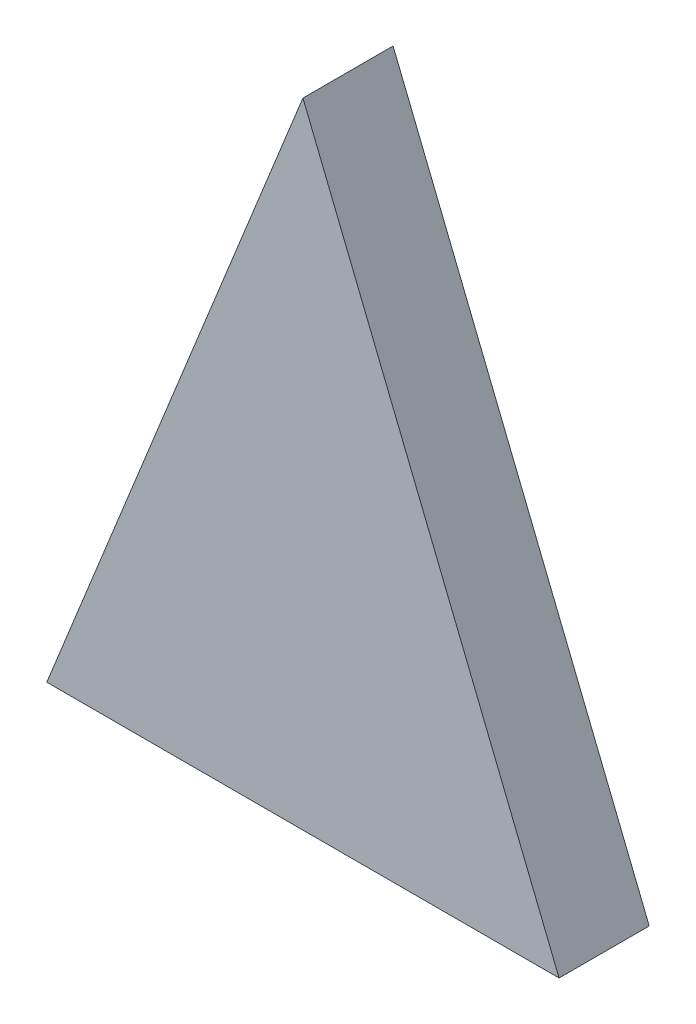
ISO-10303-21;
HEADER;
FILE_DESCRIPTION(('STEP AP214'),'2;1');
FILE_NAME('part.step','',(''),(''),'','','');
FILE_SCHEMA(('AUTOMOTIVE_DESIGN { 1 0 10303 214 1 1 1 1 }'));
ENDSEC;
DATA;
#1=APPLICATION_CONTEXT('core data for automotive mechanical design processes');
#2=APPLICATION_PROTOCOL_DEFINITION('international standard','automotive_design',2000,#1);
#3=PRODUCT_CONTEXT('',#1,'mechanical');
#4=PRODUCT('Part','Part','',(#3));
#5=PRODUCT_RELATED_PRODUCT_CATEGORY('part','',(#4));
#6=PRODUCT_DEFINITION_FORMATION('','',#4);
#7=PRODUCT_DEFINITION_CONTEXT('part definition',#1,'design');
#8=PRODUCT_DEFINITION('design','',#6,#7);
#9=PRODUCT_DEFINITION_SHAPE('','',#8);
#10=(LENGTH_UNIT() NAMED_UNIT(*) SI_UNIT(.MILLI.,.METRE.));
#11=(NAMED_UNIT(*) PLANE_ANGLE_UNIT() SI_UNIT($,.RADIAN.));
#12=(NAMED_UNIT(*) SI_UNIT($,.STERADIAN.) SOLID_ANGLE_UNIT());
#13=UNCERTAINTY_MEASURE_WITH_UNIT(LENGTH_MEASURE(1.E-05),#10,'distance_accuracy_value','');
#14=(GEOMETRIC_REPRESENTATION_CONTEXT(3) GLOBAL_UNCERTAINTY_ASSIGNED_CONTEXT((#13)) GLOBAL_UNIT_ASSIGNED_CONTEXT((#10,
#11,#12)) REPRESENTATION_CONTEXT('',''));
#15=CARTESIAN_POINT('',(0.,0.,0.));
#16=DIRECTION('',(0.,0.,1.));
#17=DIRECTION('',(1.,0.,0.));
#18=AXIS2_PLACEMENT_3D('',#15,#16,#17);
#19=CARTESIAN_POINT('',(0.029884469337526,-0.513978221792353,0.));
#20=DIRECTION('',(0.927183854567569,0.374606593413977,0.));
#21=DIRECTION('',(-0.374606593413977,0.927183854567569,0.));
#22=AXIS2_PLACEMENT_3D('',#19,#20,#21);
#23=PLANE('',#22);
#24=DIRECTION('',(-0.374606593413977,0.927183854567569,0.));
#25=VECTOR('',#24,1.);
#26=CARTESIAN_POINT('',(0.029884469337526,-0.513978221792353,0.));
#27=LINE('',#26,#25);
#28=CARTESIAN_POINT('',(0.029884469337526,-0.513978221792353,0.));
#29=VERTEX_POINT('',#28);
#30=CARTESIAN_POINT('',(0.0213589431958611,-0.492876804120534,0.));
#31=VERTEX_POINT('',#30);
#32=EDGE_CURVE('E11',#29,#31,#27,.T.);
#33=ORIENTED_EDGE('',*,*,#32,.T.);
#34=DIRECTION('',(0.,0.,1.));
#35=VECTOR('',#34,1.);
#36=CARTESIAN_POINT('',(0.0213589431958611,-0.492876804120534,0.));
#37=LINE('',#36,#35);
#38=CARTESIAN_POINT('',(0.0213589431958611,-0.492876804120534,0.003));
#39=VERTEX_POINT('',#38);
#40=EDGE_CURVE('E24',#31,#39,#37,.T.);
#41=ORIENTED_EDGE('',*,*,#40,.T.);
#42=DIRECTION('',(-0.374606593413977,0.927183854567569,0.));
#43=VECTOR('',#42,1.);
#44=CARTESIAN_POINT('',(0.029884469337526,-0.513978221792353,0.003));
#45=LINE('',#44,#43);
#46=CARTESIAN_POINT('',(0.029884469337526,-0.513978221792353,0.003));
#47=VERTEX_POINT('',#46);
#48=EDGE_CURVE('E67',#47,#39,#45,.T.);
#49=ORIENTED_EDGE('',*,*,#48,.F.);
#50=DIRECTION('',(0.,0.,1.));
#51=VECTOR('',#50,1.);
#52=CARTESIAN_POINT('',(0.029884469337526,-0.513978221792353,0.));
#53=LINE('',#52,#51);
#54=EDGE_CURVE('E54',#29,#47,#53,.T.);
#55=ORIENTED_EDGE('',*,*,#54,.F.);
#56=EDGE_LOOP('',(#33,#41,#49,#55));
#57=FACE_BOUND('',#56,.T.);
#58=ADVANCED_FACE('F17',(#57),#23,.T.);
#59=CARTESIAN_POINT('',(0.0128334170541112,-0.513978221792353,0.));
#60=DIRECTION('',(0.,-1.,0.));
#61=DIRECTION('',(1.,0.,0.));
#62=AXIS2_PLACEMENT_3D('',#59,#60,#61);
#63=PLANE('',#62);
#64=DIRECTION('',(1.,0.,0.));
#65=VECTOR('',#64,1.);
#66=CARTESIAN_POINT('',(0.0128334170541112,-0.513978221792353,0.));
#67=LINE('',#66,#65);
#68=CARTESIAN_POINT('',(0.0128334170541112,-0.513978221792353,0.));
#69=VERTEX_POINT('',#68);
#70=EDGE_CURVE('E58',#69,#29,#67,.T.);
#71=ORIENTED_EDGE('',*,*,#70,.T.);
#72=ORIENTED_EDGE('',*,*,#54,.T.);
#73=DIRECTION('',(1.,0.,0.));
#74=VECTOR('',#73,1.);
#75=CARTESIAN_POINT('',(0.0128334170541112,-0.513978221792353,0.003));
#76=LINE('',#75,#74);
#77=CARTESIAN_POINT('',(0.0128334170541112,-0.513978221792353,0.003));
#78=VERTEX_POINT('',#77);
#79=EDGE_CURVE('E48',#78,#47,#76,.T.);
#80=ORIENTED_EDGE('',*,*,#79,.F.);
#81=DIRECTION('',(0.,0.,1.));
#82=VECTOR('',#81,1.);
#83=CARTESIAN_POINT('',(0.0128334170541112,-0.513978221792353,0.));
#84=LINE('',#83,#82);
#85=EDGE_CURVE('E52',#69,#78,#84,.T.);
#86=ORIENTED_EDGE('',*,*,#85,.F.);
#87=EDGE_LOOP('',(#71,#72,#80,#86));
#88=FACE_BOUND('',#87,.T.);
#89=ADVANCED_FACE('F51',(#88),#63,.T.);
#90=CARTESIAN_POINT('',(0.0213589431958611,-0.492876804120534,0.));
#91=DIRECTION('',(-0.927183854566271,0.374606593417191,0.));
#92=DIRECTION('',(-0.374606593417191,-0.927183854566271,0.));
#93=AXIS2_PLACEMENT_3D('',#90,#91,#92);
#94=PLANE('',#93);
#95=DIRECTION('',(-0.37460659341719,-0.927183854566271,0.));
#96=VECTOR('',#95,1.);
#97=CARTESIAN_POINT('',(0.0213589431958611,-0.492876804120534,0.));
#98=LINE('',#97,#96);
#99=EDGE_CURVE('E64',#31,#69,#98,.T.);
#100=ORIENTED_EDGE('',*,*,#99,.T.);
#101=ORIENTED_EDGE('',*,*,#85,.T.);
#102=DIRECTION('',(-0.37460659341719,-0.927183854566271,0.));
#103=VECTOR('',#102,1.);
#104=CARTESIAN_POINT('',(0.0213589431958611,-0.492876804120534,0.003));
#105=LINE('',#104,#103);
#106=EDGE_CURVE('E63',#39,#78,#105,.T.);
#107=ORIENTED_EDGE('',*,*,#106,.F.);
#108=ORIENTED_EDGE('',*,*,#40,.F.);
#109=EDGE_LOOP('',(#100,#101,#107,#108));
#110=FACE_BOUND('',#109,.T.);
#111=ADVANCED_FACE('F62',(#110),#94,.T.);
#112=CARTESIAN_POINT('',(0.0213589431958186,-0.503427512956444,0.003));
#113=DIRECTION('',(0.,0.,1.));
#114=DIRECTION('',(1.,0.,0.));
#115=AXIS2_PLACEMENT_3D('',#112,#113,#114);
#116=PLANE('',#115);
#117=ORIENTED_EDGE('',*,*,#106,.T.);
#118=ORIENTED_EDGE('',*,*,#79,.T.);
#119=ORIENTED_EDGE('',*,*,#48,.T.);
#120=EDGE_LOOP('',(#117,#118,#119));
#121=FACE_BOUND('',#120,.T.);
#122=ADVANCED_FACE('F66',(#121),#116,.T.);
#123=CARTESIAN_POINT('',(0.0213589431958186,-0.503427512956444,0.));
#124=DIRECTION('',(0.,0.,1.));
#125=DIRECTION('',(1.,0.,0.));
#126=AXIS2_PLACEMENT_3D('',#123,#124,#125);
#127=PLANE('',#126);
#128=ORIENTED_EDGE('',*,*,#99,.F.);
#129=ORIENTED_EDGE('',*,*,#32,.F.);
#130=ORIENTED_EDGE('',*,*,#70,.F.);
#131=EDGE_LOOP('',(#128,#129,#130));
#132=FACE_BOUND('',#131,.T.);
#133=ADVANCED_FACE('F73',(#132),#127,.F.);
#134=CLOSED_SHELL('',(#58,#89,#111,#122,#133));
#135=MANIFOLD_SOLID_BREP('B1',#134);
#136=ADVANCED_BREP_SHAPE_REPRESENTATION('',(#18,#135),#14);
#137=SHAPE_DEFINITION_REPRESENTATION(#9,#136);
ENDSEC;
END-ISO-10303-21;
